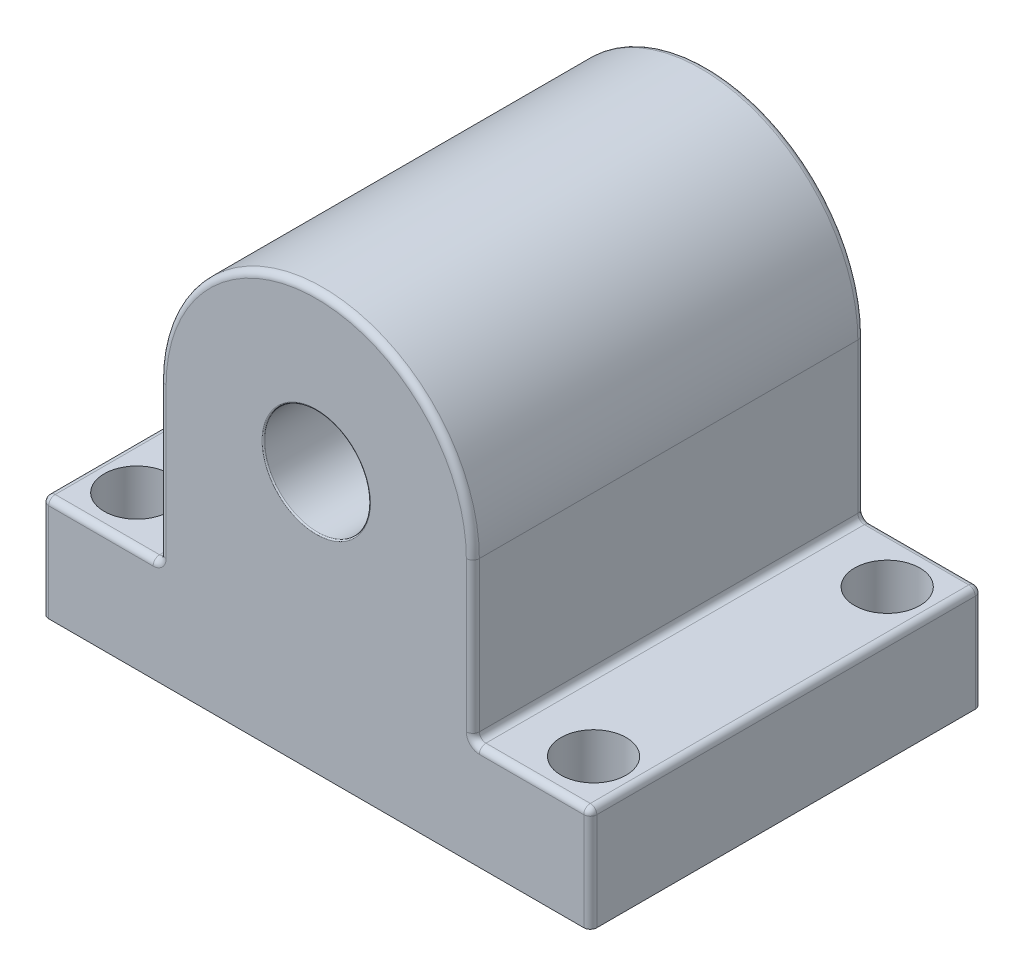
ISO-10303-21;
HEADER;
FILE_DESCRIPTION(('STEP AP214'),'2;1');
FILE_NAME('part.step','',(''),(''),'','','');
FILE_SCHEMA(('AUTOMOTIVE_DESIGN { 1 0 10303 214 1 1 1 1 }'));
ENDSEC;
DATA;
#1=APPLICATION_CONTEXT('core data for automotive mechanical design processes');
#2=APPLICATION_PROTOCOL_DEFINITION('international standard','automotive_design',2000,#1);
#3=PRODUCT_CONTEXT('',#1,'mechanical');
#4=PRODUCT('Part','Part','',(#3));
#5=PRODUCT_RELATED_PRODUCT_CATEGORY('part','',(#4));
#6=PRODUCT_DEFINITION_FORMATION('','',#4);
#7=PRODUCT_DEFINITION_CONTEXT('part definition',#1,'design');
#8=PRODUCT_DEFINITION('design','',#6,#7);
#9=PRODUCT_DEFINITION_SHAPE('','',#8);
#10=(LENGTH_UNIT() NAMED_UNIT(*) SI_UNIT(.MILLI.,.METRE.));
#11=(NAMED_UNIT(*) PLANE_ANGLE_UNIT() SI_UNIT($,.RADIAN.));
#12=(NAMED_UNIT(*) SI_UNIT($,.STERADIAN.) SOLID_ANGLE_UNIT());
#13=UNCERTAINTY_MEASURE_WITH_UNIT(LENGTH_MEASURE(1.E-05),#10,'distance_accuracy_value','');
#14=(GEOMETRIC_REPRESENTATION_CONTEXT(3) GLOBAL_UNCERTAINTY_ASSIGNED_CONTEXT((#13)) GLOBAL_UNIT_ASSIGNED_CONTEXT((#10,
#11,#12)) REPRESENTATION_CONTEXT('',''));
#15=CARTESIAN_POINT('',(0.,0.,0.));
#16=DIRECTION('',(0.,0.,1.));
#17=DIRECTION('',(1.,0.,0.));
#18=AXIS2_PLACEMENT_3D('',#15,#16,#17);
#19=CARTESIAN_POINT('',(12.,0.,-15.));
#20=DIRECTION('',(-1.,0.,0.));
#21=DIRECTION('',(0.,0.,1.));
#22=AXIS2_PLACEMENT_3D('',#19,#20,#21);
#23=PLANE('',#22);
#24=DIRECTION('',(0.,0.,1.));
#25=VECTOR('',#24,1.);
#26=CARTESIAN_POINT('',(12.,20.,-15.));
#27=LINE('',#26,#25);
#28=CARTESIAN_POINT('',(12.,20.,-14.5));
#29=VERTEX_POINT('',#28);
#30=CARTESIAN_POINT('',(12.,20.,14.5));
#31=VERTEX_POINT('',#30);
#32=EDGE_CURVE('E229',#29,#31,#27,.T.);
#33=ORIENTED_EDGE('',*,*,#32,.T.);
#34=DIRECTION('',(0.,-1.,0.));
#35=VECTOR('',#34,1.);
#36=CARTESIAN_POINT('',(12.,8.,14.5));
#37=LINE('',#36,#35);
#38=CARTESIAN_POINT('',(12.,8.5,14.5));
#39=VERTEX_POINT('',#38);
#40=EDGE_CURVE('E259',#31,#39,#37,.T.);
#41=ORIENTED_EDGE('',*,*,#40,.T.);
#42=DIRECTION('',(0.,0.,1.));
#43=VECTOR('',#42,1.);
#44=CARTESIAN_POINT('',(12.,8.5,-15.));
#45=LINE('',#44,#43);
#46=CARTESIAN_POINT('',(12.,8.5,-14.5));
#47=VERTEX_POINT('',#46);
#48=EDGE_CURVE('E255',#39,#47,#45,.F.);
#49=ORIENTED_EDGE('',*,*,#48,.T.);
#50=DIRECTION('',(0.,-1.,0.));
#51=VECTOR('',#50,1.);
#52=CARTESIAN_POINT('',(12.,0.,-14.5));
#53=LINE('',#52,#51);
#54=EDGE_CURVE('E257',#47,#29,#53,.F.);
#55=ORIENTED_EDGE('',*,*,#54,.T.);
#56=EDGE_LOOP('',(#33,#41,#49,#55));
#57=FACE_BOUND('',#56,.T.);
#58=ADVANCED_FACE('F36',(#57),#23,.F.);
#59=CARTESIAN_POINT('',(0.,8.,-15.));
#60=DIRECTION('',(0.,-1.,0.));
#61=DIRECTION('',(0.,0.,-1.));
#62=AXIS2_PLACEMENT_3D('',#59,#60,#61);
#63=PLANE('',#62);
#64=DIRECTION('',(1.,0.,0.));
#65=VECTOR('',#64,1.);
#66=CARTESIAN_POINT('',(21.,8.,14.5));
#67=LINE('',#66,#65);
#68=CARTESIAN_POINT('',(12.5,8.,14.5));
#69=VERTEX_POINT('',#68);
#70=CARTESIAN_POINT('',(20.5,8.,14.5));
#71=VERTEX_POINT('',#70);
#72=EDGE_CURVE('E197',#69,#71,#67,.T.);
#73=ORIENTED_EDGE('',*,*,#72,.T.);
#74=DIRECTION('',(0.,0.,1.));
#75=VECTOR('',#74,1.);
#76=CARTESIAN_POINT('',(20.5,8.,-15.));
#77=LINE('',#76,#75);
#78=CARTESIAN_POINT('',(20.5,8.,-14.5));
#79=VERTEX_POINT('',#78);
#80=EDGE_CURVE('E193',#71,#79,#77,.F.);
#81=ORIENTED_EDGE('',*,*,#80,.T.);
#82=DIRECTION('',(1.,0.,0.));
#83=VECTOR('',#82,1.);
#84=CARTESIAN_POINT('',(0.,8.,-14.5));
#85=LINE('',#84,#83);
#86=CARTESIAN_POINT('',(12.5,8.,-14.5));
#87=VERTEX_POINT('',#86);
#88=EDGE_CURVE('E184',#79,#87,#85,.F.);
#89=ORIENTED_EDGE('',*,*,#88,.T.);
#90=DIRECTION('',(0.,0.,1.));
#91=VECTOR('',#90,1.);
#92=CARTESIAN_POINT('',(12.5,8.,15.));
#93=LINE('',#92,#91);
#94=EDGE_CURVE('E190',#87,#69,#93,.T.);
#95=ORIENTED_EDGE('',*,*,#94,.T.);
#96=EDGE_LOOP('',(#73,#81,#89,#95));
#97=FACE_BOUND('',#96,.T.);
#98=CARTESIAN_POINT('',(17.5,8.,-11.25));
#99=DIRECTION('',(0.,1.,0.));
#100=DIRECTION('',(0.,0.,1.));
#101=AXIS2_PLACEMENT_3D('',#98,#99,#100);
#102=CIRCLE('',#101,2.5);
#103=CARTESIAN_POINT('',(17.5,8.,-8.75));
#104=VERTEX_POINT('',#103);
#105=EDGE_CURVE('E913',#104,#104,#102,.T.);
#106=ORIENTED_EDGE('',*,*,#105,.F.);
#107=EDGE_LOOP('',(#106));
#108=FACE_BOUND('',#107,.T.);
#109=CARTESIAN_POINT('',(17.5,8.,11.25));
#110=DIRECTION('',(0.,1.,0.));
#111=DIRECTION('',(0.,0.,1.));
#112=AXIS2_PLACEMENT_3D('',#109,#110,#111);
#113=CIRCLE('',#112,2.5);
#114=CARTESIAN_POINT('',(17.5,8.,13.75));
#115=VERTEX_POINT('',#114);
#116=EDGE_CURVE('E386',#115,#115,#113,.T.);
#117=ORIENTED_EDGE('',*,*,#116,.F.);
#118=EDGE_LOOP('',(#117));
#119=FACE_BOUND('',#118,.T.);
#120=ADVANCED_FACE('F187',(#97,#108,#119),#63,.F.);
#121=CARTESIAN_POINT('',(21.,0.,-15.));
#122=DIRECTION('',(-1.,0.,0.));
#123=DIRECTION('',(0.,-1.,0.));
#124=AXIS2_PLACEMENT_3D('',#121,#122,#123);
#125=PLANE('',#124);
#126=DIRECTION('',(0.,0.,1.));
#127=VECTOR('',#126,1.);
#128=CARTESIAN_POINT('',(21.,0.,-15.));
#129=LINE('',#128,#127);
#130=CARTESIAN_POINT('',(21.,0.,-14.5));
#131=VERTEX_POINT('',#130);
#132=CARTESIAN_POINT('',(21.,0.,14.5));
#133=VERTEX_POINT('',#132);
#134=EDGE_CURVE('E223',#131,#133,#129,.T.);
#135=ORIENTED_EDGE('',*,*,#134,.F.);
#136=DIRECTION('',(0.,-1.,0.));
#137=VECTOR('',#136,1.);
#138=CARTESIAN_POINT('',(21.,0.,-14.5));
#139=LINE('',#138,#137);
#140=CARTESIAN_POINT('',(21.,7.5,-14.5));
#141=VERTEX_POINT('',#140);
#142=EDGE_CURVE('E56',#131,#141,#139,.F.);
#143=ORIENTED_EDGE('',*,*,#142,.T.);
#144=DIRECTION('',(0.,0.,1.));
#145=VECTOR('',#144,1.);
#146=CARTESIAN_POINT('',(21.,7.5,-15.));
#147=LINE('',#146,#145);
#148=CARTESIAN_POINT('',(21.,7.5,14.5));
#149=VERTEX_POINT('',#148);
#150=EDGE_CURVE('E51',#141,#149,#147,.T.);
#151=ORIENTED_EDGE('',*,*,#150,.T.);
#152=DIRECTION('',(0.,-1.,0.));
#153=VECTOR('',#152,1.);
#154=CARTESIAN_POINT('',(21.,0.,14.5));
#155=LINE('',#154,#153);
#156=EDGE_CURVE('E314',#149,#133,#155,.T.);
#157=ORIENTED_EDGE('',*,*,#156,.T.);
#158=EDGE_LOOP('',(#135,#143,#151,#157));
#159=FACE_BOUND('',#158,.T.);
#160=ADVANCED_FACE('F545',(#159),#125,.F.);
#161=CARTESIAN_POINT('',(0.,0.,-15.));
#162=DIRECTION('',(0.,1.,0.));
#163=DIRECTION('',(-1.,0.,0.));
#164=AXIS2_PLACEMENT_3D('',#161,#162,#163);
#165=PLANE('',#164);
#166=CARTESIAN_POINT('',(17.5,0.,-11.25));
#167=DIRECTION('',(0.,1.,0.));
#168=DIRECTION('',(-1.,0.,0.));
#169=AXIS2_PLACEMENT_3D('',#166,#167,#168);
#170=CIRCLE('',#169,2.5);
#171=CARTESIAN_POINT('',(15.,0.,-11.25));
#172=VERTEX_POINT('',#171);
#173=EDGE_CURVE('E910',#172,#172,#170,.F.);
#174=ORIENTED_EDGE('',*,*,#173,.F.);
#175=EDGE_LOOP('',(#174));
#176=FACE_BOUND('',#175,.T.);
#177=CARTESIAN_POINT('',(-17.5,0.,11.25));
#178=DIRECTION('',(0.,1.,0.));
#179=DIRECTION('',(-1.,0.,0.));
#180=AXIS2_PLACEMENT_3D('',#177,#178,#179);
#181=CIRCLE('',#180,2.5);
#182=CARTESIAN_POINT('',(-20.,0.,11.25));
#183=VERTEX_POINT('',#182);
#184=EDGE_CURVE('E916',#183,#183,#181,.F.);
#185=ORIENTED_EDGE('',*,*,#184,.F.);
#186=EDGE_LOOP('',(#185));
#187=FACE_BOUND('',#186,.T.);
#188=CARTESIAN_POINT('',(17.5,0.,11.25));
#189=DIRECTION('',(0.,1.,0.));
#190=DIRECTION('',(-1.,0.,0.));
#191=AXIS2_PLACEMENT_3D('',#188,#189,#190);
#192=CIRCLE('',#191,2.5);
#193=CARTESIAN_POINT('',(15.,0.,11.25));
#194=VERTEX_POINT('',#193);
#195=EDGE_CURVE('E921',#194,#194,#192,.F.);
#196=ORIENTED_EDGE('',*,*,#195,.F.);
#197=EDGE_LOOP('',(#196));
#198=FACE_BOUND('',#197,.T.);
#199=CARTESIAN_POINT('',(-17.5,0.,-11.25));
#200=DIRECTION('',(0.,1.,0.));
#201=DIRECTION('',(-1.,0.,0.));
#202=AXIS2_PLACEMENT_3D('',#199,#200,#201);
#203=CIRCLE('',#202,2.5);
#204=CARTESIAN_POINT('',(-20.,0.,-11.25));
#205=VERTEX_POINT('',#204);
#206=EDGE_CURVE('E450',#205,#205,#203,.F.);
#207=ORIENTED_EDGE('',*,*,#206,.F.);
#208=EDGE_LOOP('',(#207));
#209=FACE_BOUND('',#208,.T.);
#210=DIRECTION('',(0.,0.,1.));
#211=VECTOR('',#210,1.);
#212=CARTESIAN_POINT('',(-21.,0.,-15.));
#213=LINE('',#212,#211);
#214=CARTESIAN_POINT('',(-21.,0.,-14.5));
#215=VERTEX_POINT('',#214);
#216=CARTESIAN_POINT('',(-21.,0.,14.5));
#217=VERTEX_POINT('',#216);
#218=EDGE_CURVE('E226',#215,#217,#213,.T.);
#219=ORIENTED_EDGE('',*,*,#218,.F.);
#220=CARTESIAN_POINT('',(-20.5,0.,-14.5));
#221=DIRECTION('',(0.,1.,0.));
#222=DIRECTION('',(-1.,0.,0.));
#223=AXIS2_PLACEMENT_3D('',#220,#221,#222);
#224=CIRCLE('',#223,0.5);
#225=CARTESIAN_POINT('',(-20.5,0.,-15.));
#226=VERTEX_POINT('',#225);
#227=EDGE_CURVE('E311',#215,#226,#224,.F.);
#228=ORIENTED_EDGE('',*,*,#227,.T.);
#229=DIRECTION('',(-1.,0.,0.));
#230=VECTOR('',#229,1.);
#231=CARTESIAN_POINT('',(0.,0.,-15.));
#232=LINE('',#231,#230);
#233=CARTESIAN_POINT('',(20.5,0.,-15.));
#234=VERTEX_POINT('',#233);
#235=EDGE_CURVE('E449',#234,#226,#232,.T.);
#236=ORIENTED_EDGE('',*,*,#235,.F.);
#237=CARTESIAN_POINT('',(20.5,0.,-14.5));
#238=DIRECTION('',(0.,1.,0.));
#239=DIRECTION('',(-1.,0.,0.));
#240=AXIS2_PLACEMENT_3D('',#237,#238,#239);
#241=CIRCLE('',#240,0.5);
#242=EDGE_CURVE('E309',#234,#131,#241,.F.);
#243=ORIENTED_EDGE('',*,*,#242,.T.);
#244=ORIENTED_EDGE('',*,*,#134,.T.);
#245=CARTESIAN_POINT('',(20.5,0.,14.5));
#246=DIRECTION('',(0.,1.,0.));
#247=DIRECTION('',(-1.,0.,0.));
#248=AXIS2_PLACEMENT_3D('',#245,#246,#247);
#249=CIRCLE('',#248,0.5);
#250=CARTESIAN_POINT('',(20.5,0.,15.));
#251=VERTEX_POINT('',#250);
#252=EDGE_CURVE('E307',#133,#251,#249,.F.);
#253=ORIENTED_EDGE('',*,*,#252,.T.);
#254=DIRECTION('',(-1.,0.,0.));
#255=VECTOR('',#254,1.);
#256=CARTESIAN_POINT('',(0.,0.,15.));
#257=LINE('',#256,#255);
#258=CARTESIAN_POINT('',(-20.5,0.,15.));
#259=VERTEX_POINT('',#258);
#260=EDGE_CURVE('E445',#251,#259,#257,.T.);
#261=ORIENTED_EDGE('',*,*,#260,.T.);
#262=CARTESIAN_POINT('',(-20.5,0.,14.5));
#263=DIRECTION('',(0.,1.,0.));
#264=DIRECTION('',(-1.,0.,0.));
#265=AXIS2_PLACEMENT_3D('',#262,#263,#264);
#266=CIRCLE('',#265,0.5);
#267=EDGE_CURVE('E305',#259,#217,#266,.F.);
#268=ORIENTED_EDGE('',*,*,#267,.T.);
#269=EDGE_LOOP('',(#219,#228,#236,#243,#244,#253,#261,#268));
#270=FACE_BOUND('',#269,.T.);
#271=ADVANCED_FACE('F522',(#176,#187,#198,#209,#270),#165,.F.);
#272=CARTESIAN_POINT('',(-21.,0.,-15.));
#273=DIRECTION('',(1.,0.,0.));
#274=DIRECTION('',(0.,0.,-1.));
#275=AXIS2_PLACEMENT_3D('',#272,#273,#274);
#276=PLANE('',#275);
#277=DIRECTION('',(0.,0.,1.));
#278=VECTOR('',#277,1.);
#279=CARTESIAN_POINT('',(-21.,7.5,-15.));
#280=LINE('',#279,#278);
#281=CARTESIAN_POINT('',(-21.,7.5,14.5));
#282=VERTEX_POINT('',#281);
#283=CARTESIAN_POINT('',(-21.,7.5,-14.5));
#284=VERTEX_POINT('',#283);
#285=EDGE_CURVE('E299',#282,#284,#280,.F.);
#286=ORIENTED_EDGE('',*,*,#285,.T.);
#287=DIRECTION('',(0.,1.,0.));
#288=VECTOR('',#287,1.);
#289=CARTESIAN_POINT('',(-21.,0.,-14.5));
#290=LINE('',#289,#288);
#291=EDGE_CURVE('E303',#284,#215,#290,.F.);
#292=ORIENTED_EDGE('',*,*,#291,.T.);
#293=ORIENTED_EDGE('',*,*,#218,.T.);
#294=DIRECTION('',(0.,1.,0.));
#295=VECTOR('',#294,1.);
#296=CARTESIAN_POINT('',(-21.,8.,14.5));
#297=LINE('',#296,#295);
#298=EDGE_CURVE('E301',#217,#282,#297,.T.);
#299=ORIENTED_EDGE('',*,*,#298,.T.);
#300=EDGE_LOOP('',(#286,#292,#293,#299));
#301=FACE_BOUND('',#300,.T.);
#302=ADVANCED_FACE('F525',(#301),#276,.F.);
#303=CARTESIAN_POINT('',(0.,8.,-15.));
#304=DIRECTION('',(0.,-1.,0.));
#305=DIRECTION('',(0.,0.,-1.));
#306=AXIS2_PLACEMENT_3D('',#303,#304,#305);
#307=PLANE('',#306);
#308=DIRECTION('',(0.,0.,1.));
#309=VECTOR('',#308,1.);
#310=CARTESIAN_POINT('',(-12.5,8.,-15.));
#311=LINE('',#310,#309);
#312=CARTESIAN_POINT('',(-12.5,8.,14.5));
#313=VERTEX_POINT('',#312);
#314=CARTESIAN_POINT('',(-12.5,8.,-14.5));
#315=VERTEX_POINT('',#314);
#316=EDGE_CURVE('E284',#313,#315,#311,.F.);
#317=ORIENTED_EDGE('',*,*,#316,.T.);
#318=DIRECTION('',(1.,0.,0.));
#319=VECTOR('',#318,1.);
#320=CARTESIAN_POINT('',(0.,8.,-14.5));
#321=LINE('',#320,#319);
#322=CARTESIAN_POINT('',(-20.5,8.,-14.5));
#323=VERTEX_POINT('',#322);
#324=EDGE_CURVE('E290',#315,#323,#321,.F.);
#325=ORIENTED_EDGE('',*,*,#324,.T.);
#326=DIRECTION('',(0.,0.,1.));
#327=VECTOR('',#326,1.);
#328=CARTESIAN_POINT('',(-20.5,8.,-15.));
#329=LINE('',#328,#327);
#330=CARTESIAN_POINT('',(-20.5,8.,14.5));
#331=VERTEX_POINT('',#330);
#332=EDGE_CURVE('E288',#323,#331,#329,.T.);
#333=ORIENTED_EDGE('',*,*,#332,.T.);
#334=DIRECTION('',(1.,0.,0.));
#335=VECTOR('',#334,1.);
#336=CARTESIAN_POINT('',(-12.,8.,14.5));
#337=LINE('',#336,#335);
#338=EDGE_CURVE('E286',#331,#313,#337,.T.);
#339=ORIENTED_EDGE('',*,*,#338,.T.);
#340=EDGE_LOOP('',(#317,#325,#333,#339));
#341=FACE_BOUND('',#340,.T.);
#342=CARTESIAN_POINT('',(-17.5,8.,11.25));
#343=DIRECTION('',(0.,1.,0.));
#344=DIRECTION('',(0.,0.,1.));
#345=AXIS2_PLACEMENT_3D('',#342,#343,#344);
#346=CIRCLE('',#345,2.5);
#347=CARTESIAN_POINT('',(-17.5,8.,13.75));
#348=VERTEX_POINT('',#347);
#349=EDGE_CURVE('E919',#348,#348,#346,.T.);
#350=ORIENTED_EDGE('',*,*,#349,.F.);
#351=EDGE_LOOP('',(#350));
#352=FACE_BOUND('',#351,.T.);
#353=CARTESIAN_POINT('',(-17.5,8.,-11.25));
#354=DIRECTION('',(0.,1.,0.));
#355=DIRECTION('',(0.,0.,1.));
#356=AXIS2_PLACEMENT_3D('',#353,#354,#355);
#357=CIRCLE('',#356,2.5);
#358=CARTESIAN_POINT('',(-17.5,8.,-8.75));
#359=VERTEX_POINT('',#358);
#360=EDGE_CURVE('E454',#359,#359,#357,.T.);
#361=ORIENTED_EDGE('',*,*,#360,.F.);
#362=EDGE_LOOP('',(#361));
#363=FACE_BOUND('',#362,.T.);
#364=ADVANCED_FACE('F540',(#341,#352,#363),#307,.F.);
#365=CARTESIAN_POINT('',(-12.,0.,-15.));
#366=DIRECTION('',(1.,0.,0.));
#367=DIRECTION('',(0.,0.,-1.));
#368=AXIS2_PLACEMENT_3D('',#365,#366,#367);
#369=PLANE('',#368);
#370=DIRECTION('',(0.,0.,1.));
#371=VECTOR('',#370,1.);
#372=CARTESIAN_POINT('',(-12.,8.5,15.));
#373=LINE('',#372,#371);
#374=CARTESIAN_POINT('',(-12.,8.5,-14.5));
#375=VERTEX_POINT('',#374);
#376=CARTESIAN_POINT('',(-12.,8.5,14.5));
#377=VERTEX_POINT('',#376);
#378=EDGE_CURVE('E293',#375,#377,#373,.T.);
#379=ORIENTED_EDGE('',*,*,#378,.T.);
#380=DIRECTION('',(0.,1.,0.));
#381=VECTOR('',#380,1.);
#382=CARTESIAN_POINT('',(-12.,20.,14.5));
#383=LINE('',#382,#381);
#384=CARTESIAN_POINT('',(-12.,20.,14.5));
#385=VERTEX_POINT('',#384);
#386=EDGE_CURVE('E297',#377,#385,#383,.T.);
#387=ORIENTED_EDGE('',*,*,#386,.T.);
#388=DIRECTION('',(0.,0.,1.));
#389=VECTOR('',#388,1.);
#390=CARTESIAN_POINT('',(-12.,20.,-15.));
#391=LINE('',#390,#389);
#392=CARTESIAN_POINT('',(-12.,20.,-14.5));
#393=VERTEX_POINT('',#392);
#394=EDGE_CURVE('E458',#393,#385,#391,.T.);
#395=ORIENTED_EDGE('',*,*,#394,.F.);
#396=DIRECTION('',(0.,1.,0.));
#397=VECTOR('',#396,1.);
#398=CARTESIAN_POINT('',(-12.,0.,-14.5));
#399=LINE('',#398,#397);
#400=EDGE_CURVE('E295',#393,#375,#399,.F.);
#401=ORIENTED_EDGE('',*,*,#400,.T.);
#402=EDGE_LOOP('',(#379,#387,#395,#401));
#403=FACE_BOUND('',#402,.T.);
#404=ADVANCED_FACE('F407',(#403),#369,.F.);
#405=CARTESIAN_POINT('',(0.,20.,-15.));
#406=DIRECTION('',(0.,0.,1.));
#407=DIRECTION('',(1.,0.,0.));
#408=AXIS2_PLACEMENT_3D('',#405,#406,#407);
#409=CYLINDRICAL_SURFACE('',#408,4.05);
#410=CARTESIAN_POINT('',(0.,20.,14.9));
#411=DIRECTION('',(0.,0.,1.));
#412=DIRECTION('',(1.,0.,0.));
#413=AXIS2_PLACEMENT_3D('',#410,#411,#412);
#414=CIRCLE('',#413,4.05);
#415=CARTESIAN_POINT('',(4.04999999999999,20.,14.9));
#416=VERTEX_POINT('',#415);
#417=EDGE_CURVE('E389',#416,#416,#414,.T.);
#418=ORIENTED_EDGE('',*,*,#417,.T.);
#419=EDGE_LOOP('',(#418));
#420=FACE_BOUND('',#419,.T.);
#421=CARTESIAN_POINT('',(0.,20.,-14.9));
#422=DIRECTION('',(0.,0.,1.));
#423=DIRECTION('',(1.,0.,0.));
#424=AXIS2_PLACEMENT_3D('',#421,#422,#423);
#425=CIRCLE('',#424,4.05);
#426=CARTESIAN_POINT('',(4.04999999999999,20.,-14.9));
#427=VERTEX_POINT('',#426);
#428=EDGE_CURVE('E317',#427,#427,#425,.F.);
#429=ORIENTED_EDGE('',*,*,#428,.T.);
#430=EDGE_LOOP('',(#429));
#431=FACE_BOUND('',#430,.T.);
#432=ADVANCED_FACE('F403',(#420,#431),#409,.F.);
#433=CARTESIAN_POINT('',(0.,20.,-15.));
#434=DIRECTION('',(0.,0.,1.));
#435=DIRECTION('',(1.,0.,0.));
#436=AXIS2_PLACEMENT_3D('',#433,#434,#435);
#437=CYLINDRICAL_SURFACE('',#436,12.);
#438=ORIENTED_EDGE('',*,*,#394,.T.);
#439=CARTESIAN_POINT('',(0.,20.,14.5));
#440=DIRECTION('',(0.,0.,1.));
#441=DIRECTION('',(1.,0.,0.));
#442=AXIS2_PLACEMENT_3D('',#439,#440,#441);
#443=CIRCLE('',#442,12.);
#444=EDGE_CURVE('E264',#385,#31,#443,.F.);
#445=ORIENTED_EDGE('',*,*,#444,.T.);
#446=ORIENTED_EDGE('',*,*,#32,.F.);
#447=CARTESIAN_POINT('',(0.,20.,-14.5));
#448=DIRECTION('',(0.,0.,1.));
#449=DIRECTION('',(1.,0.,0.));
#450=AXIS2_PLACEMENT_3D('',#447,#448,#449);
#451=CIRCLE('',#450,12.);
#452=EDGE_CURVE('E262',#29,#393,#451,.T.);
#453=ORIENTED_EDGE('',*,*,#452,.T.);
#454=EDGE_LOOP('',(#438,#445,#446,#453));
#455=FACE_BOUND('',#454,.T.);
#456=ADVANCED_FACE('F406',(#455),#437,.T.);
#457=CARTESIAN_POINT('',(0.,0.,-15.));
#458=DIRECTION('',(0.,0.,1.));
#459=DIRECTION('',(1.,0.,0.));
#460=AXIS2_PLACEMENT_3D('',#457,#458,#459);
#461=PLANE('',#460);
#462=CARTESIAN_POINT('',(0.,20.,-15.));
#463=DIRECTION('',(0.,0.,1.));
#464=DIRECTION('',(1.,0.,0.));
#465=AXIS2_PLACEMENT_3D('',#462,#463,#464);
#466=CIRCLE('',#465,4.15);
#467=CARTESIAN_POINT('',(4.14999999999999,20.,-15.));
#468=VERTEX_POINT('',#467);
#469=EDGE_CURVE('E11',#468,#468,#466,.T.);
#470=ORIENTED_EDGE('',*,*,#469,.T.);
#471=EDGE_LOOP('',(#470));
#472=FACE_BOUND('',#471,.T.);
#473=DIRECTION('',(1.,0.,0.));
#474=VECTOR('',#473,1.);
#475=CARTESIAN_POINT('',(0.,7.5,-15.));
#476=LINE('',#475,#474);
#477=CARTESIAN_POINT('',(12.5,7.5,-15.));
#478=VERTEX_POINT('',#477);
#479=CARTESIAN_POINT('',(20.5,7.5,-15.));
#480=VERTEX_POINT('',#479);
#481=EDGE_CURVE('E204',#478,#480,#476,.T.);
#482=ORIENTED_EDGE('',*,*,#481,.T.);
#483=DIRECTION('',(0.,-1.,0.));
#484=VECTOR('',#483,1.);
#485=CARTESIAN_POINT('',(20.5,0.,-15.));
#486=LINE('',#485,#484);
#487=EDGE_CURVE('E282',#480,#234,#486,.T.);
#488=ORIENTED_EDGE('',*,*,#487,.T.);
#489=ORIENTED_EDGE('',*,*,#235,.T.);
#490=DIRECTION('',(0.,1.,0.));
#491=VECTOR('',#490,1.);
#492=CARTESIAN_POINT('',(-20.5,0.,-15.));
#493=LINE('',#492,#491);
#494=CARTESIAN_POINT('',(-20.5,7.5,-15.));
#495=VERTEX_POINT('',#494);
#496=EDGE_CURVE('E277',#226,#495,#493,.T.);
#497=ORIENTED_EDGE('',*,*,#496,.T.);
#498=DIRECTION('',(1.,0.,0.));
#499=VECTOR('',#498,1.);
#500=CARTESIAN_POINT('',(0.,7.5,-15.));
#501=LINE('',#500,#499);
#502=CARTESIAN_POINT('',(-12.5,7.5,-15.));
#503=VERTEX_POINT('',#502);
#504=EDGE_CURVE('E275',#495,#503,#501,.T.);
#505=ORIENTED_EDGE('',*,*,#504,.T.);
#506=CARTESIAN_POINT('',(-12.5,8.5,-15.));
#507=DIRECTION('',(0.,0.,1.));
#508=DIRECTION('',(1.,0.,0.));
#509=AXIS2_PLACEMENT_3D('',#506,#507,#508);
#510=CIRCLE('',#509,1.);
#511=CARTESIAN_POINT('',(-11.5,8.5,-15.));
#512=VERTEX_POINT('',#511);
#513=EDGE_CURVE('E272',#512,#503,#510,.F.);
#514=ORIENTED_EDGE('',*,*,#513,.F.);
#515=DIRECTION('',(0.,1.,0.));
#516=VECTOR('',#515,1.);
#517=CARTESIAN_POINT('',(-11.5,0.,-15.));
#518=LINE('',#517,#516);
#519=CARTESIAN_POINT('',(-11.5,20.,-15.));
#520=VERTEX_POINT('',#519);
#521=EDGE_CURVE('E266',#512,#520,#518,.T.);
#522=ORIENTED_EDGE('',*,*,#521,.T.);
#523=CARTESIAN_POINT('',(0.,20.,-15.));
#524=DIRECTION('',(0.,0.,1.));
#525=DIRECTION('',(1.,0.,0.));
#526=AXIS2_PLACEMENT_3D('',#523,#524,#525);
#527=CIRCLE('',#526,11.5);
#528=CARTESIAN_POINT('',(11.5,20.,-15.));
#529=VERTEX_POINT('',#528);
#530=EDGE_CURVE('E268',#520,#529,#527,.F.);
#531=ORIENTED_EDGE('',*,*,#530,.T.);
#532=DIRECTION('',(0.,-1.,0.));
#533=VECTOR('',#532,1.);
#534=CARTESIAN_POINT('',(11.5,0.,-15.));
#535=LINE('',#534,#533);
#536=CARTESIAN_POINT('',(11.5,8.5,-15.));
#537=VERTEX_POINT('',#536);
#538=EDGE_CURVE('E270',#529,#537,#535,.T.);
#539=ORIENTED_EDGE('',*,*,#538,.T.);
#540=CARTESIAN_POINT('',(12.5,8.5,-15.));
#541=DIRECTION('',(0.,0.,1.));
#542=DIRECTION('',(1.,0.,0.));
#543=AXIS2_PLACEMENT_3D('',#540,#541,#542);
#544=CIRCLE('',#543,1.);
#545=EDGE_CURVE('E279',#478,#537,#544,.F.);
#546=ORIENTED_EDGE('',*,*,#545,.F.);
#547=EDGE_LOOP('',(#482,#488,#489,#497,#505,#514,#522,#531,#539,#546));
#548=FACE_BOUND('',#547,.T.);
#549=ADVANCED_FACE('F415',(#472,#548),#461,.F.);
#550=CARTESIAN_POINT('',(0.,0.,15.));
#551=DIRECTION('',(0.,0.,1.));
#552=DIRECTION('',(1.,0.,0.));
#553=AXIS2_PLACEMENT_3D('',#550,#551,#552);
#554=PLANE('',#553);
#555=CARTESIAN_POINT('',(0.,20.,15.));
#556=DIRECTION('',(0.,0.,1.));
#557=DIRECTION('',(1.,0.,0.));
#558=AXIS2_PLACEMENT_3D('',#555,#556,#557);
#559=CIRCLE('',#558,4.15);
#560=CARTESIAN_POINT('',(4.14999999999999,20.,15.));
#561=VERTEX_POINT('',#560);
#562=EDGE_CURVE('E44',#561,#561,#559,.F.);
#563=ORIENTED_EDGE('',*,*,#562,.T.);
#564=EDGE_LOOP('',(#563));
#565=FACE_BOUND('',#564,.T.);
#566=ORIENTED_EDGE('',*,*,#260,.F.);
#567=DIRECTION('',(0.,-1.,0.));
#568=VECTOR('',#567,1.);
#569=CARTESIAN_POINT('',(20.5,8.,15.));
#570=LINE('',#569,#568);
#571=CARTESIAN_POINT('',(20.5,7.5,15.));
#572=VERTEX_POINT('',#571);
#573=EDGE_CURVE('E253',#251,#572,#570,.F.);
#574=ORIENTED_EDGE('',*,*,#573,.T.);
#575=DIRECTION('',(1.,0.,0.));
#576=VECTOR('',#575,1.);
#577=CARTESIAN_POINT('',(12.,7.5,15.));
#578=LINE('',#577,#576);
#579=CARTESIAN_POINT('',(12.5,7.5,15.));
#580=VERTEX_POINT('',#579);
#581=EDGE_CURVE('E250',#572,#580,#578,.F.);
#582=ORIENTED_EDGE('',*,*,#581,.T.);
#583=CARTESIAN_POINT('',(12.5,8.5,15.));
#584=DIRECTION('',(0.,0.,1.));
#585=DIRECTION('',(1.,0.,0.));
#586=AXIS2_PLACEMENT_3D('',#583,#584,#585);
#587=CIRCLE('',#586,1.);
#588=CARTESIAN_POINT('',(11.5,8.5,15.));
#589=VERTEX_POINT('',#588);
#590=EDGE_CURVE('E247',#589,#580,#587,.T.);
#591=ORIENTED_EDGE('',*,*,#590,.F.);
#592=DIRECTION('',(0.,-1.,0.));
#593=VECTOR('',#592,1.);
#594=CARTESIAN_POINT('',(11.5,20.,15.));
#595=LINE('',#594,#593);
#596=CARTESIAN_POINT('',(11.5,20.,15.));
#597=VERTEX_POINT('',#596);
#598=EDGE_CURVE('E245',#589,#597,#595,.F.);
#599=ORIENTED_EDGE('',*,*,#598,.T.);
#600=CARTESIAN_POINT('',(0.,20.,15.));
#601=DIRECTION('',(0.,0.,1.));
#602=DIRECTION('',(1.,0.,0.));
#603=AXIS2_PLACEMENT_3D('',#600,#601,#602);
#604=CIRCLE('',#603,11.5);
#605=CARTESIAN_POINT('',(-11.5,20.,15.));
#606=VERTEX_POINT('',#605);
#607=EDGE_CURVE('E243',#597,#606,#604,.T.);
#608=ORIENTED_EDGE('',*,*,#607,.T.);
#609=DIRECTION('',(0.,1.,0.));
#610=VECTOR('',#609,1.);
#611=CARTESIAN_POINT('',(-11.5,8.,15.));
#612=LINE('',#611,#610);
#613=CARTESIAN_POINT('',(-11.5,8.5,15.));
#614=VERTEX_POINT('',#613);
#615=EDGE_CURVE('E241',#606,#614,#612,.F.);
#616=ORIENTED_EDGE('',*,*,#615,.T.);
#617=CARTESIAN_POINT('',(-12.5,8.5,15.));
#618=DIRECTION('',(0.,0.,1.));
#619=DIRECTION('',(1.,0.,0.));
#620=AXIS2_PLACEMENT_3D('',#617,#618,#619);
#621=CIRCLE('',#620,1.);
#622=CARTESIAN_POINT('',(-12.5,7.5,15.));
#623=VERTEX_POINT('',#622);
#624=EDGE_CURVE('E238',#623,#614,#621,.T.);
#625=ORIENTED_EDGE('',*,*,#624,.F.);
#626=DIRECTION('',(1.,0.,0.));
#627=VECTOR('',#626,1.);
#628=CARTESIAN_POINT('',(-21.,7.5,15.));
#629=LINE('',#628,#627);
#630=CARTESIAN_POINT('',(-20.5,7.5,15.));
#631=VERTEX_POINT('',#630);
#632=EDGE_CURVE('E234',#623,#631,#629,.F.);
#633=ORIENTED_EDGE('',*,*,#632,.T.);
#634=DIRECTION('',(0.,1.,0.));
#635=VECTOR('',#634,1.);
#636=CARTESIAN_POINT('',(-20.5,0.,15.));
#637=LINE('',#636,#635);
#638=EDGE_CURVE('E236',#631,#259,#637,.F.);
#639=ORIENTED_EDGE('',*,*,#638,.T.);
#640=EDGE_LOOP('',(#566,#574,#582,#591,#599,#608,#616,#625,#633,#639));
#641=FACE_BOUND('',#640,.T.);
#642=ADVANCED_FACE('F394',(#565,#641),#554,.T.);
#643=CARTESIAN_POINT('',(-17.5,-0.00100000000000447,-11.25));
#644=DIRECTION('',(0.,1.,0.));
#645=DIRECTION('',(0.,0.,1.));
#646=AXIS2_PLACEMENT_3D('',#643,#644,#645);
#647=CYLINDRICAL_SURFACE('',#646,2.5);
#648=ORIENTED_EDGE('',*,*,#360,.T.);
#649=EDGE_LOOP('',(#648));
#650=FACE_BOUND('',#649,.T.);
#651=ORIENTED_EDGE('',*,*,#206,.T.);
#652=EDGE_LOOP('',(#651));
#653=FACE_BOUND('',#652,.T.);
#654=ADVANCED_FACE('F632',(#650,#653),#647,.F.);
#655=CARTESIAN_POINT('',(-17.5,-0.00100000000000447,11.25));
#656=DIRECTION('',(0.,1.,0.));
#657=DIRECTION('',(0.,0.,1.));
#658=AXIS2_PLACEMENT_3D('',#655,#656,#657);
#659=CYLINDRICAL_SURFACE('',#658,2.5);
#660=ORIENTED_EDGE('',*,*,#349,.T.);
#661=EDGE_LOOP('',(#660));
#662=FACE_BOUND('',#661,.T.);
#663=ORIENTED_EDGE('',*,*,#184,.T.);
#664=EDGE_LOOP('',(#663));
#665=FACE_BOUND('',#664,.T.);
#666=ADVANCED_FACE('F624',(#662,#665),#659,.F.);
#667=CARTESIAN_POINT('',(17.5,-0.00100000000000447,11.25));
#668=DIRECTION('',(0.,1.,0.));
#669=DIRECTION('',(0.,0.,1.));
#670=AXIS2_PLACEMENT_3D('',#667,#668,#669);
#671=CYLINDRICAL_SURFACE('',#670,2.5);
#672=ORIENTED_EDGE('',*,*,#116,.T.);
#673=EDGE_LOOP('',(#672));
#674=FACE_BOUND('',#673,.T.);
#675=ORIENTED_EDGE('',*,*,#195,.T.);
#676=EDGE_LOOP('',(#675));
#677=FACE_BOUND('',#676,.T.);
#678=ADVANCED_FACE('F618',(#674,#677),#671,.F.);
#679=CARTESIAN_POINT('',(17.5,-0.00100000000000447,-11.25));
#680=DIRECTION('',(0.,1.,0.));
#681=DIRECTION('',(0.,0.,1.));
#682=AXIS2_PLACEMENT_3D('',#679,#680,#681);
#683=CYLINDRICAL_SURFACE('',#682,2.5);
#684=ORIENTED_EDGE('',*,*,#105,.T.);
#685=EDGE_LOOP('',(#684));
#686=FACE_BOUND('',#685,.T.);
#687=ORIENTED_EDGE('',*,*,#173,.T.);
#688=EDGE_LOOP('',(#687));
#689=FACE_BOUND('',#688,.T.);
#690=ADVANCED_FACE('F614',(#686,#689),#683,.F.);
#691=CARTESIAN_POINT('',(-20.5,0.,-14.5));
#692=DIRECTION('',(0.,1.,0.));
#693=DIRECTION('',(0.,0.,1.));
#694=AXIS2_PLACEMENT_3D('',#691,#692,#693);
#695=CYLINDRICAL_SURFACE('',#694,0.5);
#696=CARTESIAN_POINT('',(-20.5,7.5,-14.5));
#697=DIRECTION('',(0.,1.,0.));
#698=DIRECTION('',(0.,0.,1.));
#699=AXIS2_PLACEMENT_3D('',#696,#697,#698);
#700=CIRCLE('',#699,0.5);
#701=EDGE_CURVE('E383',#495,#284,#700,.T.);
#702=ORIENTED_EDGE('',*,*,#701,.F.);
#703=ORIENTED_EDGE('',*,*,#496,.F.);
#704=ORIENTED_EDGE('',*,*,#227,.F.);
#705=ORIENTED_EDGE('',*,*,#291,.F.);
#706=EDGE_LOOP('',(#702,#703,#704,#705));
#707=FACE_BOUND('',#706,.T.);
#708=ADVANCED_FACE('F530',(#707),#695,.T.);
#709=CARTESIAN_POINT('',(-20.5,7.5,-14.5));
#710=DIRECTION('',(0.,0.,1.));
#711=DIRECTION('',(1.,0.,0.));
#712=AXIS2_PLACEMENT_3D('',#709,#710,#711);
#713=SPHERICAL_SURFACE('',#712,0.5);
#714=CARTESIAN_POINT('',(-20.5,7.5,-14.5));
#715=DIRECTION('',(-1.,0.,0.));
#716=DIRECTION('',(0.,0.,1.));
#717=AXIS2_PLACEMENT_3D('',#714,#715,#716);
#718=CIRCLE('',#717,0.5);
#719=EDGE_CURVE('E377',#495,#323,#718,.F.);
#720=ORIENTED_EDGE('',*,*,#719,.F.);
#721=ORIENTED_EDGE('',*,*,#701,.T.);
#722=CARTESIAN_POINT('',(-20.5,7.5,-14.5));
#723=DIRECTION('',(0.,0.,-1.));
#724=DIRECTION('',(-1.,0.,0.));
#725=AXIS2_PLACEMENT_3D('',#722,#723,#724);
#726=CIRCLE('',#725,0.5);
#727=EDGE_CURVE('E380',#323,#284,#726,.F.);
#728=ORIENTED_EDGE('',*,*,#727,.F.);
#729=EDGE_LOOP('',(#720,#721,#728));
#730=FACE_BOUND('',#729,.T.);
#731=ADVANCED_FACE('F535',(#730),#713,.T.);
#732=CARTESIAN_POINT('',(-20.5,0.,14.5));
#733=DIRECTION('',(0.,-1.,0.));
#734=DIRECTION('',(0.,0.,-1.));
#735=AXIS2_PLACEMENT_3D('',#732,#733,#734);
#736=CYLINDRICAL_SURFACE('',#735,0.5);
#737=ORIENTED_EDGE('',*,*,#267,.F.);
#738=ORIENTED_EDGE('',*,*,#638,.F.);
#739=CARTESIAN_POINT('',(-20.5,7.5,14.5));
#740=DIRECTION('',(0.,1.,0.));
#741=DIRECTION('',(0.,0.,1.));
#742=AXIS2_PLACEMENT_3D('',#739,#740,#741);
#743=CIRCLE('',#742,0.5);
#744=EDGE_CURVE('E374',#282,#631,#743,.T.);
#745=ORIENTED_EDGE('',*,*,#744,.F.);
#746=ORIENTED_EDGE('',*,*,#298,.F.);
#747=EDGE_LOOP('',(#737,#738,#745,#746));
#748=FACE_BOUND('',#747,.T.);
#749=ADVANCED_FACE('F520',(#748),#736,.T.);
#750=CARTESIAN_POINT('',(-20.5,7.5,-15.));
#751=DIRECTION('',(0.,0.,1.));
#752=DIRECTION('',(1.,0.,0.));
#753=AXIS2_PLACEMENT_3D('',#750,#751,#752);
#754=CYLINDRICAL_SURFACE('',#753,0.5);
#755=ORIENTED_EDGE('',*,*,#727,.T.);
#756=ORIENTED_EDGE('',*,*,#285,.F.);
#757=CARTESIAN_POINT('',(-20.5,7.5,14.5));
#758=DIRECTION('',(0.,0.,1.));
#759=DIRECTION('',(1.,0.,0.));
#760=AXIS2_PLACEMENT_3D('',#757,#758,#759);
#761=CIRCLE('',#760,0.5);
#762=EDGE_CURVE('E371',#331,#282,#761,.T.);
#763=ORIENTED_EDGE('',*,*,#762,.F.);
#764=ORIENTED_EDGE('',*,*,#332,.F.);
#765=EDGE_LOOP('',(#755,#756,#763,#764));
#766=FACE_BOUND('',#765,.T.);
#767=ADVANCED_FACE('F538',(#766),#754,.T.);
#768=CARTESIAN_POINT('',(0.,7.5,-14.5));
#769=DIRECTION('',(1.,0.,0.));
#770=DIRECTION('',(0.,0.,-1.));
#771=AXIS2_PLACEMENT_3D('',#768,#769,#770);
#772=CYLINDRICAL_SURFACE('',#771,0.5);
#773=ORIENTED_EDGE('',*,*,#719,.T.);
#774=ORIENTED_EDGE('',*,*,#324,.F.);
#775=CARTESIAN_POINT('',(-12.5,7.5,-14.5));
#776=DIRECTION('',(1.,0.,0.));
#777=DIRECTION('',(0.,0.,-1.));
#778=AXIS2_PLACEMENT_3D('',#775,#776,#777);
#779=CIRCLE('',#778,0.5);
#780=EDGE_CURVE('E368',#503,#315,#779,.T.);
#781=ORIENTED_EDGE('',*,*,#780,.F.);
#782=ORIENTED_EDGE('',*,*,#504,.F.);
#783=EDGE_LOOP('',(#773,#774,#781,#782));
#784=FACE_BOUND('',#783,.T.);
#785=ADVANCED_FACE('F544',(#784),#772,.T.);
#786=CARTESIAN_POINT('',(-20.5,7.5,14.5));
#787=DIRECTION('',(0.,0.,1.));
#788=DIRECTION('',(1.,0.,0.));
#789=AXIS2_PLACEMENT_3D('',#786,#787,#788);
#790=SPHERICAL_SURFACE('',#789,0.5);
#791=ORIENTED_EDGE('',*,*,#762,.T.);
#792=ORIENTED_EDGE('',*,*,#744,.T.);
#793=CARTESIAN_POINT('',(-20.5,7.5,14.5));
#794=DIRECTION('',(-1.,0.,0.));
#795=DIRECTION('',(0.,0.,1.));
#796=AXIS2_PLACEMENT_3D('',#793,#794,#795);
#797=CIRCLE('',#796,0.5);
#798=EDGE_CURVE('E365',#331,#631,#797,.F.);
#799=ORIENTED_EDGE('',*,*,#798,.F.);
#800=EDGE_LOOP('',(#791,#792,#799));
#801=FACE_BOUND('',#800,.T.);
#802=ADVANCED_FACE('F515',(#801),#790,.T.);
#803=CARTESIAN_POINT('',(-12.5,8.5,-14.5));
#804=DIRECTION('',(0.,0.,1.));
#805=DIRECTION('',(1.,0.,0.));
#806=AXIS2_PLACEMENT_3D('',#803,#804,#805);
#807=TOROIDAL_SURFACE('',#806,1.,0.5);
#808=ORIENTED_EDGE('',*,*,#513,.T.);
#809=ORIENTED_EDGE('',*,*,#780,.T.);
#810=CARTESIAN_POINT('',(-12.5,8.5,-14.5));
#811=DIRECTION('',(0.,0.,1.));
#812=DIRECTION('',(1.,0.,0.));
#813=AXIS2_PLACEMENT_3D('',#810,#811,#812);
#814=CIRCLE('',#813,0.5);
#815=EDGE_CURVE('E362',#375,#315,#814,.F.);
#816=ORIENTED_EDGE('',*,*,#815,.F.);
#817=CARTESIAN_POINT('',(-11.5,8.5,-14.5));
#818=DIRECTION('',(0.,-1.,0.));
#819=DIRECTION('',(0.,0.,-1.));
#820=AXIS2_PLACEMENT_3D('',#817,#818,#819);
#821=CIRCLE('',#820,0.5);
#822=EDGE_CURVE('E359',#512,#375,#821,.F.);
#823=ORIENTED_EDGE('',*,*,#822,.F.);
#824=EDGE_LOOP('',(#808,#809,#816,#823));
#825=FACE_BOUND('',#824,.T.);
#826=ADVANCED_FACE('F496',(#825),#807,.T.);
#827=CARTESIAN_POINT('',(0.,7.5,14.5));
#828=DIRECTION('',(-1.,0.,0.));
#829=DIRECTION('',(0.,0.,1.));
#830=AXIS2_PLACEMENT_3D('',#827,#828,#829);
#831=CYLINDRICAL_SURFACE('',#830,0.5);
#832=ORIENTED_EDGE('',*,*,#798,.T.);
#833=ORIENTED_EDGE('',*,*,#632,.F.);
#834=CARTESIAN_POINT('',(-12.5,7.5,14.5));
#835=DIRECTION('',(1.,0.,0.));
#836=DIRECTION('',(0.,0.,-1.));
#837=AXIS2_PLACEMENT_3D('',#834,#835,#836);
#838=CIRCLE('',#837,0.5);
#839=EDGE_CURVE('E356',#313,#623,#838,.T.);
#840=ORIENTED_EDGE('',*,*,#839,.F.);
#841=ORIENTED_EDGE('',*,*,#338,.F.);
#842=EDGE_LOOP('',(#832,#833,#840,#841));
#843=FACE_BOUND('',#842,.T.);
#844=ADVANCED_FACE('F511',(#843),#831,.T.);
#845=CARTESIAN_POINT('',(-12.5,8.5,-15.));
#846=DIRECTION('',(0.,0.,-1.));
#847=DIRECTION('',(-1.,0.,0.));
#848=AXIS2_PLACEMENT_3D('',#845,#846,#847);
#849=CYLINDRICAL_SURFACE('',#848,0.5);
#850=ORIENTED_EDGE('',*,*,#815,.T.);
#851=ORIENTED_EDGE('',*,*,#316,.F.);
#852=CARTESIAN_POINT('',(-12.5,8.5,14.5));
#853=DIRECTION('',(0.,0.,1.));
#854=DIRECTION('',(1.,0.,0.));
#855=AXIS2_PLACEMENT_3D('',#852,#853,#854);
#856=CIRCLE('',#855,0.5);
#857=EDGE_CURVE('E353',#377,#313,#856,.F.);
#858=ORIENTED_EDGE('',*,*,#857,.F.);
#859=ORIENTED_EDGE('',*,*,#378,.F.);
#860=EDGE_LOOP('',(#850,#851,#858,#859));
#861=FACE_BOUND('',#860,.T.);
#862=ADVANCED_FACE('F501',(#861),#849,.F.);
#863=CARTESIAN_POINT('',(-11.5,0.,-14.5));
#864=DIRECTION('',(0.,1.,0.));
#865=DIRECTION('',(0.,0.,1.));
#866=AXIS2_PLACEMENT_3D('',#863,#864,#865);
#867=CYLINDRICAL_SURFACE('',#866,0.5);
#868=ORIENTED_EDGE('',*,*,#822,.T.);
#869=ORIENTED_EDGE('',*,*,#400,.F.);
#870=CARTESIAN_POINT('',(-11.5,20.,-14.5));
#871=DIRECTION('',(0.,1.,0.));
#872=DIRECTION('',(0.,0.,1.));
#873=AXIS2_PLACEMENT_3D('',#870,#871,#872);
#874=CIRCLE('',#873,0.5);
#875=EDGE_CURVE('E350',#520,#393,#874,.T.);
#876=ORIENTED_EDGE('',*,*,#875,.F.);
#877=ORIENTED_EDGE('',*,*,#521,.F.);
#878=EDGE_LOOP('',(#868,#869,#876,#877));
#879=FACE_BOUND('',#878,.T.);
#880=ADVANCED_FACE('F490',(#879),#867,.T.);
#881=CARTESIAN_POINT('',(-12.5,8.5,14.5));
#882=DIRECTION('',(0.,0.,1.));
#883=DIRECTION('',(1.,0.,0.));
#884=AXIS2_PLACEMENT_3D('',#881,#882,#883);
#885=TOROIDAL_SURFACE('',#884,1.,0.5);
#886=ORIENTED_EDGE('',*,*,#839,.T.);
#887=ORIENTED_EDGE('',*,*,#624,.T.);
#888=CARTESIAN_POINT('',(-11.5,8.5,14.5));
#889=DIRECTION('',(0.,-1.,0.));
#890=DIRECTION('',(0.,0.,-1.));
#891=AXIS2_PLACEMENT_3D('',#888,#889,#890);
#892=CIRCLE('',#891,0.5);
#893=EDGE_CURVE('E347',#377,#614,#892,.F.);
#894=ORIENTED_EDGE('',*,*,#893,.F.);
#895=ORIENTED_EDGE('',*,*,#857,.T.);
#896=EDGE_LOOP('',(#886,#887,#894,#895));
#897=FACE_BOUND('',#896,.T.);
#898=ADVANCED_FACE('F505',(#897),#885,.T.);
#899=CARTESIAN_POINT('',(0.,20.,-14.5));
#900=DIRECTION('',(0.,0.,1.));
#901=DIRECTION('',(1.,0.,0.));
#902=AXIS2_PLACEMENT_3D('',#899,#900,#901);
#903=TOROIDAL_SURFACE('',#902,11.5,0.5);
#904=ORIENTED_EDGE('',*,*,#875,.T.);
#905=ORIENTED_EDGE('',*,*,#452,.F.);
#906=CARTESIAN_POINT('',(11.5,20.,-14.5));
#907=DIRECTION('',(0.,-1.,0.));
#908=DIRECTION('',(0.,0.,-1.));
#909=AXIS2_PLACEMENT_3D('',#906,#907,#908);
#910=CIRCLE('',#909,0.5);
#911=EDGE_CURVE('E344',#529,#29,#910,.T.);
#912=ORIENTED_EDGE('',*,*,#911,.F.);
#913=ORIENTED_EDGE('',*,*,#530,.F.);
#914=EDGE_LOOP('',(#904,#905,#912,#913));
#915=FACE_BOUND('',#914,.T.);
#916=ADVANCED_FACE('F484',(#915),#903,.T.);
#917=CARTESIAN_POINT('',(-11.5,0.,14.5));
#918=DIRECTION('',(0.,-1.,0.));
#919=DIRECTION('',(0.,0.,-1.));
#920=AXIS2_PLACEMENT_3D('',#917,#918,#919);
#921=CYLINDRICAL_SURFACE('',#920,0.5);
#922=ORIENTED_EDGE('',*,*,#893,.T.);
#923=ORIENTED_EDGE('',*,*,#615,.F.);
#924=CARTESIAN_POINT('',(-11.5,20.,14.5));
#925=DIRECTION('',(0.,1.,0.));
#926=DIRECTION('',(0.,0.,1.));
#927=AXIS2_PLACEMENT_3D('',#924,#925,#926);
#928=CIRCLE('',#927,0.5);
#929=EDGE_CURVE('E341',#385,#606,#928,.T.);
#930=ORIENTED_EDGE('',*,*,#929,.F.);
#931=ORIENTED_EDGE('',*,*,#386,.F.);
#932=EDGE_LOOP('',(#922,#923,#930,#931));
#933=FACE_BOUND('',#932,.T.);
#934=ADVANCED_FACE('F508',(#933),#921,.T.);
#935=CARTESIAN_POINT('',(11.5,0.,-14.5));
#936=DIRECTION('',(0.,-1.,0.));
#937=DIRECTION('',(0.,0.,-1.));
#938=AXIS2_PLACEMENT_3D('',#935,#936,#937);
#939=CYLINDRICAL_SURFACE('',#938,0.5);
#940=ORIENTED_EDGE('',*,*,#911,.T.);
#941=ORIENTED_EDGE('',*,*,#54,.F.);
#942=CARTESIAN_POINT('',(11.5,8.5,-14.5));
#943=DIRECTION('',(0.,-1.,0.));
#944=DIRECTION('',(0.,0.,-1.));
#945=AXIS2_PLACEMENT_3D('',#942,#943,#944);
#946=CIRCLE('',#945,0.5);
#947=EDGE_CURVE('E207',#537,#47,#946,.T.);
#948=ORIENTED_EDGE('',*,*,#947,.F.);
#949=ORIENTED_EDGE('',*,*,#538,.F.);
#950=EDGE_LOOP('',(#940,#941,#948,#949));
#951=FACE_BOUND('',#950,.T.);
#952=ADVANCED_FACE('F479',(#951),#939,.T.);
#953=CARTESIAN_POINT('',(0.,7.5,-14.5));
#954=DIRECTION('',(1.,0.,0.));
#955=DIRECTION('',(0.,0.,-1.));
#956=AXIS2_PLACEMENT_3D('',#953,#954,#955);
#957=CYLINDRICAL_SURFACE('',#956,0.5);
#958=CARTESIAN_POINT('',(20.5,7.5,-14.5));
#959=DIRECTION('',(1.,0.,0.));
#960=DIRECTION('',(0.,0.,-1.));
#961=AXIS2_PLACEMENT_3D('',#958,#959,#960);
#962=CIRCLE('',#961,0.5);
#963=EDGE_CURVE('E208',#480,#79,#962,.T.);
#964=ORIENTED_EDGE('',*,*,#963,.F.);
#965=ORIENTED_EDGE('',*,*,#481,.F.);
#966=CARTESIAN_POINT('',(12.5,7.5,-14.5));
#967=DIRECTION('',(-1.,0.,0.));
#968=DIRECTION('',(0.,0.,1.));
#969=AXIS2_PLACEMENT_3D('',#966,#967,#968);
#970=CIRCLE('',#969,0.5);
#971=EDGE_CURVE('E201',#87,#478,#970,.T.);
#972=ORIENTED_EDGE('',*,*,#971,.F.);
#973=ORIENTED_EDGE('',*,*,#88,.F.);
#974=EDGE_LOOP('',(#964,#965,#972,#973));
#975=FACE_BOUND('',#974,.T.);
#976=ADVANCED_FACE('F203',(#975),#957,.T.);
#977=CARTESIAN_POINT('',(20.5,0.,-14.5));
#978=DIRECTION('',(0.,-1.,0.));
#979=DIRECTION('',(1.,0.,0.));
#980=AXIS2_PLACEMENT_3D('',#977,#978,#979);
#981=CYLINDRICAL_SURFACE('',#980,0.5);
#982=ORIENTED_EDGE('',*,*,#242,.F.);
#983=ORIENTED_EDGE('',*,*,#487,.F.);
#984=CARTESIAN_POINT('',(20.5,7.5,-14.5));
#985=DIRECTION('',(0.,1.,0.));
#986=DIRECTION('',(0.,0.,1.));
#987=AXIS2_PLACEMENT_3D('',#984,#985,#986);
#988=CIRCLE('',#987,0.5);
#989=EDGE_CURVE('E336',#141,#480,#988,.T.);
#990=ORIENTED_EDGE('',*,*,#989,.F.);
#991=ORIENTED_EDGE('',*,*,#142,.F.);
#992=EDGE_LOOP('',(#982,#983,#990,#991));
#993=FACE_BOUND('',#992,.T.);
#994=ADVANCED_FACE('F424',(#993),#981,.T.);
#995=CARTESIAN_POINT('',(0.,20.,14.5));
#996=DIRECTION('',(0.,0.,1.));
#997=DIRECTION('',(1.,0.,0.));
#998=AXIS2_PLACEMENT_3D('',#995,#996,#997);
#999=TOROIDAL_SURFACE('',#998,11.5,0.5);
#1000=ORIENTED_EDGE('',*,*,#929,.T.);
#1001=ORIENTED_EDGE('',*,*,#607,.F.);
#1002=CARTESIAN_POINT('',(11.5,20.,14.5));
#1003=DIRECTION('',(0.,-1.,0.));
#1004=DIRECTION('',(0.,0.,-1.));
#1005=AXIS2_PLACEMENT_3D('',#1002,#1003,#1004);
#1006=CIRCLE('',#1005,0.5);
#1007=EDGE_CURVE('E217',#31,#597,#1006,.T.);
#1008=ORIENTED_EDGE('',*,*,#1007,.F.);
#1009=ORIENTED_EDGE('',*,*,#444,.F.);
#1010=EDGE_LOOP('',(#1000,#1001,#1008,#1009));
#1011=FACE_BOUND('',#1010,.T.);
#1012=ADVANCED_FACE('F473',(#1011),#999,.T.);
#1013=CARTESIAN_POINT('',(12.5,8.5,-14.5));
#1014=DIRECTION('',(0.,0.,1.));
#1015=DIRECTION('',(1.,0.,0.));
#1016=AXIS2_PLACEMENT_3D('',#1013,#1014,#1015);
#1017=TOROIDAL_SURFACE('',#1016,1.,0.5);
#1018=ORIENTED_EDGE('',*,*,#545,.T.);
#1019=ORIENTED_EDGE('',*,*,#947,.T.);
#1020=CARTESIAN_POINT('',(12.5,8.5,-14.5));
#1021=DIRECTION('',(0.,0.,1.));
#1022=DIRECTION('',(1.,0.,0.));
#1023=AXIS2_PLACEMENT_3D('',#1020,#1021,#1022);
#1024=CIRCLE('',#1023,0.5);
#1025=EDGE_CURVE('E212',#87,#47,#1024,.F.);
#1026=ORIENTED_EDGE('',*,*,#1025,.F.);
#1027=ORIENTED_EDGE('',*,*,#971,.T.);
#1028=EDGE_LOOP('',(#1018,#1019,#1026,#1027));
#1029=FACE_BOUND('',#1028,.T.);
#1030=ADVANCED_FACE('F213',(#1029),#1017,.T.);
#1031=CARTESIAN_POINT('',(20.5,7.5,-14.5));
#1032=DIRECTION('',(0.,0.,1.));
#1033=DIRECTION('',(1.,0.,0.));
#1034=AXIS2_PLACEMENT_3D('',#1031,#1032,#1033);
#1035=SPHERICAL_SURFACE('',#1034,0.5);
#1036=ORIENTED_EDGE('',*,*,#989,.T.);
#1037=ORIENTED_EDGE('',*,*,#963,.T.);
#1038=CARTESIAN_POINT('',(20.5,7.5,-14.5));
#1039=DIRECTION('',(0.,0.,-1.));
#1040=DIRECTION('',(-1.,0.,0.));
#1041=AXIS2_PLACEMENT_3D('',#1038,#1039,#1040);
#1042=CIRCLE('',#1041,0.5);
#1043=EDGE_CURVE('E218',#141,#79,#1042,.F.);
#1044=ORIENTED_EDGE('',*,*,#1043,.F.);
#1045=EDGE_LOOP('',(#1036,#1037,#1044));
#1046=FACE_BOUND('',#1045,.T.);
#1047=ADVANCED_FACE('F427',(#1046),#1035,.T.);
#1048=CARTESIAN_POINT('',(11.5,0.,14.5));
#1049=DIRECTION('',(0.,1.,0.));
#1050=DIRECTION('',(0.,0.,1.));
#1051=AXIS2_PLACEMENT_3D('',#1048,#1049,#1050);
#1052=CYLINDRICAL_SURFACE('',#1051,0.5);
#1053=ORIENTED_EDGE('',*,*,#1007,.T.);
#1054=ORIENTED_EDGE('',*,*,#598,.F.);
#1055=CARTESIAN_POINT('',(11.5,8.5,14.5));
#1056=DIRECTION('',(0.,-1.,0.));
#1057=DIRECTION('',(0.,0.,-1.));
#1058=AXIS2_PLACEMENT_3D('',#1055,#1056,#1057);
#1059=CIRCLE('',#1058,0.5);
#1060=EDGE_CURVE('E329',#39,#589,#1059,.T.);
#1061=ORIENTED_EDGE('',*,*,#1060,.F.);
#1062=ORIENTED_EDGE('',*,*,#40,.F.);
#1063=EDGE_LOOP('',(#1053,#1054,#1061,#1062));
#1064=FACE_BOUND('',#1063,.T.);
#1065=ADVANCED_FACE('F476',(#1064),#1052,.T.);
#1066=CARTESIAN_POINT('',(12.5,8.5,-15.));
#1067=DIRECTION('',(0.,0.,-1.));
#1068=DIRECTION('',(-1.,0.,0.));
#1069=AXIS2_PLACEMENT_3D('',#1066,#1067,#1068);
#1070=CYLINDRICAL_SURFACE('',#1069,0.5);
#1071=ORIENTED_EDGE('',*,*,#1025,.T.);
#1072=ORIENTED_EDGE('',*,*,#48,.F.);
#1073=CARTESIAN_POINT('',(12.5,8.5,14.5));
#1074=DIRECTION('',(0.,0.,1.));
#1075=DIRECTION('',(1.,0.,0.));
#1076=AXIS2_PLACEMENT_3D('',#1073,#1074,#1075);
#1077=CIRCLE('',#1076,0.5);
#1078=EDGE_CURVE('E221',#69,#39,#1077,.F.);
#1079=ORIENTED_EDGE('',*,*,#1078,.F.);
#1080=ORIENTED_EDGE('',*,*,#94,.F.);
#1081=EDGE_LOOP('',(#1071,#1072,#1079,#1080));
#1082=FACE_BOUND('',#1081,.T.);
#1083=ADVANCED_FACE('F220',(#1082),#1070,.F.);
#1084=CARTESIAN_POINT('',(20.5,7.5,-15.));
#1085=DIRECTION('',(0.,0.,1.));
#1086=DIRECTION('',(1.,0.,0.));
#1087=AXIS2_PLACEMENT_3D('',#1084,#1085,#1086);
#1088=CYLINDRICAL_SURFACE('',#1087,0.5);
#1089=ORIENTED_EDGE('',*,*,#1043,.T.);
#1090=ORIENTED_EDGE('',*,*,#80,.F.);
#1091=CARTESIAN_POINT('',(20.5,7.5,14.5));
#1092=DIRECTION('',(0.,0.,1.));
#1093=DIRECTION('',(1.,0.,0.));
#1094=AXIS2_PLACEMENT_3D('',#1091,#1092,#1093);
#1095=CIRCLE('',#1094,0.5);
#1096=EDGE_CURVE('E325',#149,#71,#1095,.T.);
#1097=ORIENTED_EDGE('',*,*,#1096,.F.);
#1098=ORIENTED_EDGE('',*,*,#150,.F.);
#1099=EDGE_LOOP('',(#1089,#1090,#1097,#1098));
#1100=FACE_BOUND('',#1099,.T.);
#1101=ADVANCED_FACE('F430',(#1100),#1088,.T.);
#1102=CARTESIAN_POINT('',(20.5,0.,14.5));
#1103=DIRECTION('',(0.,1.,0.));
#1104=DIRECTION('',(-1.,0.,0.));
#1105=AXIS2_PLACEMENT_3D('',#1102,#1103,#1104);
#1106=CYLINDRICAL_SURFACE('',#1105,0.5);
#1107=ORIENTED_EDGE('',*,*,#252,.F.);
#1108=ORIENTED_EDGE('',*,*,#156,.F.);
#1109=CARTESIAN_POINT('',(20.5,7.5,14.5));
#1110=DIRECTION('',(0.,1.,0.));
#1111=DIRECTION('',(0.,0.,1.));
#1112=AXIS2_PLACEMENT_3D('',#1109,#1110,#1111);
#1113=CIRCLE('',#1112,0.5);
#1114=EDGE_CURVE('E322',#572,#149,#1113,.T.);
#1115=ORIENTED_EDGE('',*,*,#1114,.F.);
#1116=ORIENTED_EDGE('',*,*,#573,.F.);
#1117=EDGE_LOOP('',(#1107,#1108,#1115,#1116));
#1118=FACE_BOUND('',#1117,.T.);
#1119=ADVANCED_FACE('F439',(#1118),#1106,.T.);
#1120=CARTESIAN_POINT('',(12.5,8.5,14.5));
#1121=DIRECTION('',(0.,0.,1.));
#1122=DIRECTION('',(1.,0.,0.));
#1123=AXIS2_PLACEMENT_3D('',#1120,#1121,#1122);
#1124=TOROIDAL_SURFACE('',#1123,1.,0.5);
#1125=ORIENTED_EDGE('',*,*,#1060,.T.);
#1126=ORIENTED_EDGE('',*,*,#590,.T.);
#1127=CARTESIAN_POINT('',(12.5,7.5,14.5));
#1128=DIRECTION('',(-1.,0.,0.));
#1129=DIRECTION('',(0.,0.,1.));
#1130=AXIS2_PLACEMENT_3D('',#1127,#1128,#1129);
#1131=CIRCLE('',#1130,0.5);
#1132=EDGE_CURVE('E320',#69,#580,#1131,.F.);
#1133=ORIENTED_EDGE('',*,*,#1132,.F.);
#1134=ORIENTED_EDGE('',*,*,#1078,.T.);
#1135=EDGE_LOOP('',(#1125,#1126,#1133,#1134));
#1136=FACE_BOUND('',#1135,.T.);
#1137=ADVANCED_FACE('F566',(#1136),#1124,.T.);
#1138=CARTESIAN_POINT('',(20.5,7.5,14.5));
#1139=DIRECTION('',(0.,0.,1.));
#1140=DIRECTION('',(1.,0.,0.));
#1141=AXIS2_PLACEMENT_3D('',#1138,#1139,#1140);
#1142=SPHERICAL_SURFACE('',#1141,0.5);
#1143=ORIENTED_EDGE('',*,*,#1114,.T.);
#1144=ORIENTED_EDGE('',*,*,#1096,.T.);
#1145=CARTESIAN_POINT('',(20.5,7.5,14.5));
#1146=DIRECTION('',(1.,0.,0.));
#1147=DIRECTION('',(0.,0.,-1.));
#1148=AXIS2_PLACEMENT_3D('',#1145,#1146,#1147);
#1149=CIRCLE('',#1148,0.5);
#1150=EDGE_CURVE('E318',#572,#71,#1149,.F.);
#1151=ORIENTED_EDGE('',*,*,#1150,.F.);
#1152=EDGE_LOOP('',(#1143,#1144,#1151));
#1153=FACE_BOUND('',#1152,.T.);
#1154=ADVANCED_FACE('F434',(#1153),#1142,.T.);
#1155=CARTESIAN_POINT('',(0.,7.5,14.5));
#1156=DIRECTION('',(-1.,0.,0.));
#1157=DIRECTION('',(0.,0.,1.));
#1158=AXIS2_PLACEMENT_3D('',#1155,#1156,#1157);
#1159=CYLINDRICAL_SURFACE('',#1158,0.5);
#1160=ORIENTED_EDGE('',*,*,#1132,.T.);
#1161=ORIENTED_EDGE('',*,*,#581,.F.);
#1162=ORIENTED_EDGE('',*,*,#1150,.T.);
#1163=ORIENTED_EDGE('',*,*,#72,.F.);
#1164=EDGE_LOOP('',(#1160,#1161,#1162,#1163));
#1165=FACE_BOUND('',#1164,.T.);
#1166=ADVANCED_FACE('F400',(#1165),#1159,.T.);
#1167=CARTESIAN_POINT('',(0.,20.,14.9));
#1168=DIRECTION('',(0.,0.,1.));
#1169=DIRECTION('',(1.,0.,0.));
#1170=AXIS2_PLACEMENT_3D('',#1167,#1168,#1169);
#1171=TOROIDAL_SURFACE('',#1170,4.15,0.1);
#1172=ORIENTED_EDGE('',*,*,#562,.F.);
#1173=EDGE_LOOP('',(#1172));
#1174=FACE_BOUND('',#1173,.T.);
#1175=ORIENTED_EDGE('',*,*,#417,.F.);
#1176=EDGE_LOOP('',(#1175));
#1177=FACE_BOUND('',#1176,.T.);
#1178=ADVANCED_FACE('F397',(#1174,#1177),#1171,.T.);
#1179=CARTESIAN_POINT('',(0.,20.,-14.9));
#1180=DIRECTION('',(0.,0.,1.));
#1181=DIRECTION('',(1.,0.,0.));
#1182=AXIS2_PLACEMENT_3D('',#1179,#1180,#1181);
#1183=TOROIDAL_SURFACE('',#1182,4.15,0.1);
#1184=ORIENTED_EDGE('',*,*,#428,.F.);
#1185=EDGE_LOOP('',(#1184));
#1186=FACE_BOUND('',#1185,.T.);
#1187=ORIENTED_EDGE('',*,*,#469,.F.);
#1188=EDGE_LOOP('',(#1187));
#1189=FACE_BOUND('',#1188,.T.);
#1190=ADVANCED_FACE('F38',(#1186,#1189),#1183,.T.);
#1191=CLOSED_SHELL('',(#58,#120,#160,#271,#302,#364,#404,#432,#456,#549,#642,#654,#666,#678,
#690,#708,#731,#749,#767,#785,#802,#826,#844,#862,#880,#898,#916,#934,#952,#976,#994,#1012,
#1030,#1047,#1065,#1083,#1101,#1119,#1137,#1154,#1166,#1178,#1190));
#1192=MANIFOLD_SOLID_BREP('B2',#1191);
#1193=ADVANCED_BREP_SHAPE_REPRESENTATION('',(#18,#1192),#14);
#1194=SHAPE_DEFINITION_REPRESENTATION(#9,#1193);
ENDSEC;
END-ISO-10303-21;
